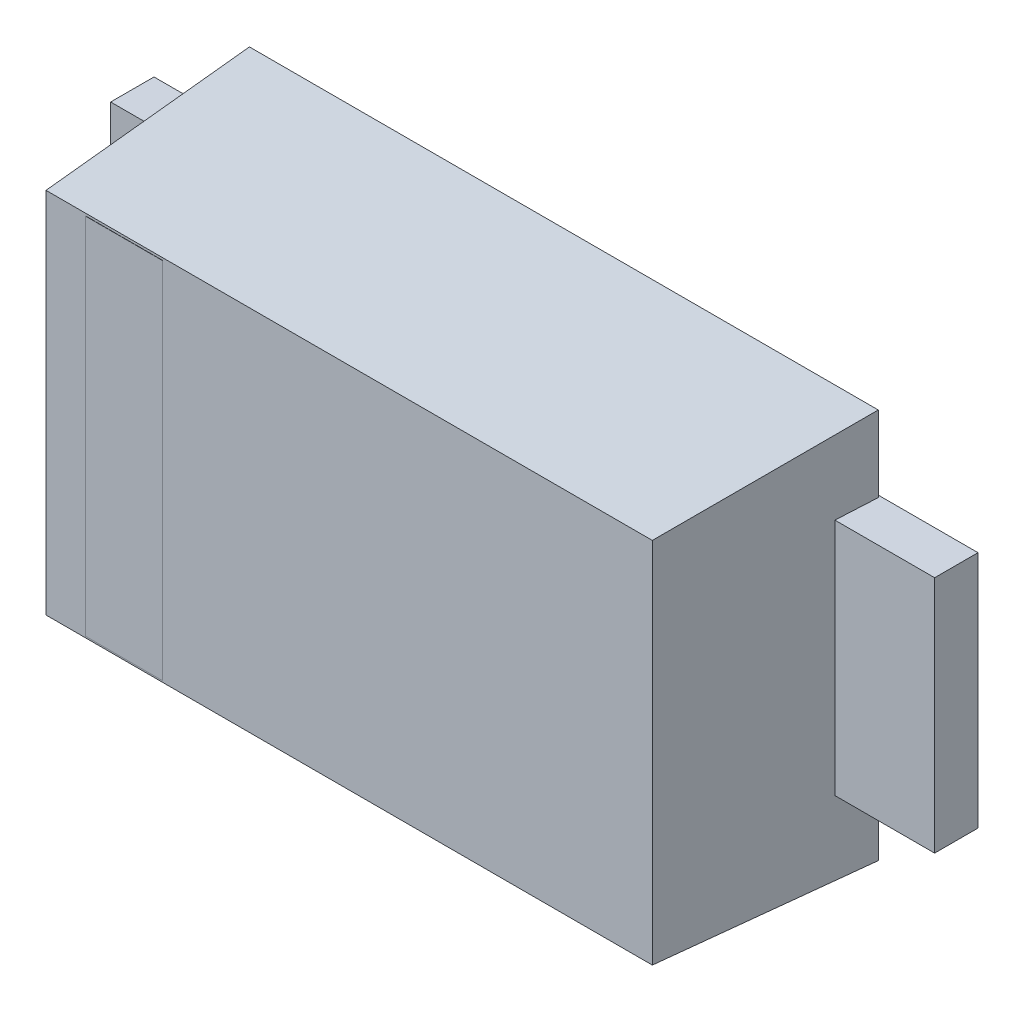
ISO-10303-21;
HEADER;
FILE_DESCRIPTION(('STEP AP214'),'2;1');
FILE_NAME('part.step','',(''),(''),'','','');
FILE_SCHEMA(('AUTOMOTIVE_DESIGN { 1 0 10303 214 1 1 1 1 }'));
ENDSEC;
DATA;
#1=APPLICATION_CONTEXT('core data for automotive mechanical design processes');
#2=APPLICATION_PROTOCOL_DEFINITION('international standard','automotive_design',2000,#1);
#3=PRODUCT_CONTEXT('',#1,'mechanical');
#4=PRODUCT('Part','Part','',(#3));
#5=PRODUCT_RELATED_PRODUCT_CATEGORY('part','',(#4));
#6=PRODUCT_DEFINITION_FORMATION('','',#4);
#7=PRODUCT_DEFINITION_CONTEXT('part definition',#1,'design');
#8=PRODUCT_DEFINITION('design','',#6,#7);
#9=PRODUCT_DEFINITION_SHAPE('','',#8);
#10=(LENGTH_UNIT() NAMED_UNIT(*) SI_UNIT(.MILLI.,.METRE.));
#11=(NAMED_UNIT(*) PLANE_ANGLE_UNIT() SI_UNIT($,.RADIAN.));
#12=(NAMED_UNIT(*) SI_UNIT($,.STERADIAN.) SOLID_ANGLE_UNIT());
#13=UNCERTAINTY_MEASURE_WITH_UNIT(LENGTH_MEASURE(1.E-05),#10,'distance_accuracy_value','');
#14=(GEOMETRIC_REPRESENTATION_CONTEXT(3) GLOBAL_UNCERTAINTY_ASSIGNED_CONTEXT((#13)) GLOBAL_UNIT_ASSIGNED_CONTEXT((#10,
#11,#12)) REPRESENTATION_CONTEXT('',''));
#15=CARTESIAN_POINT('',(0.,0.,0.));
#16=DIRECTION('',(0.,0.,1.));
#17=DIRECTION('',(1.,0.,0.));
#18=AXIS2_PLACEMENT_3D('',#15,#16,#17);
#19=CARTESIAN_POINT('',(-1.9,0.,0.));
#20=DIRECTION('',(-1.,0.,0.));
#21=DIRECTION('',(0.,0.,1.));
#22=AXIS2_PLACEMENT_3D('',#19,#20,#21);
#23=PLANE('',#22);
#24=DIRECTION('',(0.,1.,0.));
#25=VECTOR('',#24,1.);
#26=CARTESIAN_POINT('',(-1.9,0.,0.));
#27=LINE('',#26,#25);
#28=CARTESIAN_POINT('',(-1.9,0.55,0.));
#29=VERTEX_POINT('',#28);
#30=CARTESIAN_POINT('',(-1.9,-0.55,0.));
#31=VERTEX_POINT('',#30);
#32=EDGE_CURVE('E262',#29,#31,#27,.F.);
#33=ORIENTED_EDGE('',*,*,#32,.T.);
#34=DIRECTION('',(0.,0.,1.));
#35=VECTOR('',#34,1.);
#36=CARTESIAN_POINT('',(-1.9,-0.55,0.));
#37=LINE('',#36,#35);
#38=CARTESIAN_POINT('',(-1.9,-0.55,0.2));
#39=VERTEX_POINT('',#38);
#40=EDGE_CURVE('E237',#39,#31,#37,.F.);
#41=ORIENTED_EDGE('',*,*,#40,.F.);
#42=DIRECTION('',(0.,1.,0.));
#43=VECTOR('',#42,1.);
#44=CARTESIAN_POINT('',(-1.9,0.,0.2));
#45=LINE('',#44,#43);
#46=CARTESIAN_POINT('',(-1.9,0.55,0.2));
#47=VERTEX_POINT('',#46);
#48=EDGE_CURVE('E243',#47,#39,#45,.F.);
#49=ORIENTED_EDGE('',*,*,#48,.F.);
#50=DIRECTION('',(0.,0.,1.));
#51=VECTOR('',#50,1.);
#52=CARTESIAN_POINT('',(-1.9,0.55,0.));
#53=LINE('',#52,#51);
#54=EDGE_CURVE('E248',#29,#47,#53,.T.);
#55=ORIENTED_EDGE('',*,*,#54,.F.);
#56=EDGE_LOOP('',(#33,#41,#49,#55));
#57=FACE_BOUND('',#56,.T.);
#58=ADVANCED_FACE('F17',(#57),#23,.T.);
#59=CARTESIAN_POINT('',(-1.425,0.,0.));
#60=DIRECTION('',(0.,0.,1.));
#61=DIRECTION('',(1.,0.,0.));
#62=AXIS2_PLACEMENT_3D('',#59,#60,#61);
#63=PLANE('',#62);
#64=DIRECTION('',(-1.,0.,0.));
#65=VECTOR('',#64,1.);
#66=CARTESIAN_POINT('',(-1.425,0.55,0.));
#67=LINE('',#66,#65);
#68=CARTESIAN_POINT('',(-0.95,0.55,0.));
#69=VERTEX_POINT('',#68);
#70=EDGE_CURVE('E250',#69,#29,#67,.T.);
#71=ORIENTED_EDGE('',*,*,#70,.F.);
#72=DIRECTION('',(0.,1.,0.));
#73=VECTOR('',#72,1.);
#74=CARTESIAN_POINT('',(-0.95,0.,0.));
#75=LINE('',#74,#73);
#76=CARTESIAN_POINT('',(-0.95,-0.55,0.));
#77=VERTEX_POINT('',#76);
#78=EDGE_CURVE('E260',#77,#69,#75,.T.);
#79=ORIENTED_EDGE('',*,*,#78,.F.);
#80=DIRECTION('',(1.,0.,0.));
#81=VECTOR('',#80,1.);
#82=CARTESIAN_POINT('',(-1.425,-0.55,0.));
#83=LINE('',#82,#81);
#84=EDGE_CURVE('E234',#31,#77,#83,.T.);
#85=ORIENTED_EDGE('',*,*,#84,.F.);
#86=ORIENTED_EDGE('',*,*,#32,.F.);
#87=EDGE_LOOP('',(#71,#79,#85,#86));
#88=FACE_BOUND('',#87,.T.);
#89=ADVANCED_FACE('F557',(#88),#63,.F.);
#90=CARTESIAN_POINT('',(-0.95,0.,0.));
#91=DIRECTION('',(1.,0.,0.));
#92=DIRECTION('',(0.,0.,-1.));
#93=AXIS2_PLACEMENT_3D('',#90,#91,#92);
#94=PLANE('',#93);
#95=ORIENTED_EDGE('',*,*,#78,.T.);
#96=DIRECTION('',(0.,0.,1.));
#97=VECTOR('',#96,1.);
#98=CARTESIAN_POINT('',(-0.95,0.55,0.));
#99=LINE('',#98,#97);
#100=CARTESIAN_POINT('',(-0.95,0.55,0.01));
#101=VERTEX_POINT('',#100);
#102=EDGE_CURVE('E253',#101,#69,#99,.F.);
#103=ORIENTED_EDGE('',*,*,#102,.F.);
#104=DIRECTION('',(0.,-1.,0.));
#105=VECTOR('',#104,1.);
#106=CARTESIAN_POINT('',(-0.95,0.,0.01));
#107=LINE('',#106,#105);
#108=CARTESIAN_POINT('',(-0.95,-0.55,0.01));
#109=VERTEX_POINT('',#108);
#110=EDGE_CURVE('E229',#101,#109,#107,.T.);
#111=ORIENTED_EDGE('',*,*,#110,.T.);
#112=DIRECTION('',(0.,0.,1.));
#113=VECTOR('',#112,1.);
#114=CARTESIAN_POINT('',(-0.95,-0.55,0.));
#115=LINE('',#114,#113);
#116=EDGE_CURVE('E231',#77,#109,#115,.T.);
#117=ORIENTED_EDGE('',*,*,#116,.F.);
#118=EDGE_LOOP('',(#95,#103,#111,#117));
#119=FACE_BOUND('',#118,.T.);
#120=ADVANCED_FACE('F367',(#119),#94,.T.);
#121=CARTESIAN_POINT('',(1.9,0.,0.));
#122=DIRECTION('',(1.,0.,0.));
#123=DIRECTION('',(0.,0.,-1.));
#124=AXIS2_PLACEMENT_3D('',#121,#122,#123);
#125=PLANE('',#124);
#126=DIRECTION('',(0.,1.,0.));
#127=VECTOR('',#126,1.);
#128=CARTESIAN_POINT('',(1.9,0.,0.));
#129=LINE('',#128,#127);
#130=CARTESIAN_POINT('',(1.9,-0.55,0.));
#131=VERTEX_POINT('',#130);
#132=CARTESIAN_POINT('',(1.9,0.55,0.));
#133=VERTEX_POINT('',#132);
#134=EDGE_CURVE('E258',#131,#133,#129,.T.);
#135=ORIENTED_EDGE('',*,*,#134,.T.);
#136=DIRECTION('',(0.,0.,1.));
#137=VECTOR('',#136,1.);
#138=CARTESIAN_POINT('',(1.9,0.55,0.));
#139=LINE('',#138,#137);
#140=CARTESIAN_POINT('',(1.9,0.55,0.2));
#141=VERTEX_POINT('',#140);
#142=EDGE_CURVE('E193',#141,#133,#139,.F.);
#143=ORIENTED_EDGE('',*,*,#142,.F.);
#144=DIRECTION('',(0.,1.,0.));
#145=VECTOR('',#144,1.);
#146=CARTESIAN_POINT('',(1.9,0.,0.2));
#147=LINE('',#146,#145);
#148=CARTESIAN_POINT('',(1.9,-0.55,0.2));
#149=VERTEX_POINT('',#148);
#150=EDGE_CURVE('E202',#149,#141,#147,.T.);
#151=ORIENTED_EDGE('',*,*,#150,.F.);
#152=DIRECTION('',(0.,0.,1.));
#153=VECTOR('',#152,1.);
#154=CARTESIAN_POINT('',(1.9,-0.55,0.));
#155=LINE('',#154,#153);
#156=EDGE_CURVE('E207',#131,#149,#155,.T.);
#157=ORIENTED_EDGE('',*,*,#156,.F.);
#158=EDGE_LOOP('',(#135,#143,#151,#157));
#159=FACE_BOUND('',#158,.T.);
#160=ADVANCED_FACE('F354',(#159),#125,.T.);
#161=CARTESIAN_POINT('',(1.425,0.,0.));
#162=DIRECTION('',(0.,0.,1.));
#163=DIRECTION('',(1.,0.,0.));
#164=AXIS2_PLACEMENT_3D('',#161,#162,#163);
#165=PLANE('',#164);
#166=DIRECTION('',(1.,0.,0.));
#167=VECTOR('',#166,1.);
#168=CARTESIAN_POINT('',(1.425,-0.55,0.));
#169=LINE('',#168,#167);
#170=CARTESIAN_POINT('',(0.95,-0.55,0.));
#171=VERTEX_POINT('',#170);
#172=EDGE_CURVE('E209',#171,#131,#169,.T.);
#173=ORIENTED_EDGE('',*,*,#172,.F.);
#174=DIRECTION('',(0.,1.,0.));
#175=VECTOR('',#174,1.);
#176=CARTESIAN_POINT('',(0.95,0.,0.));
#177=LINE('',#176,#175);
#178=CARTESIAN_POINT('',(0.95,0.55,0.));
#179=VERTEX_POINT('',#178);
#180=EDGE_CURVE('E256',#179,#171,#177,.F.);
#181=ORIENTED_EDGE('',*,*,#180,.F.);
#182=DIRECTION('',(-1.,0.,0.));
#183=VECTOR('',#182,1.);
#184=CARTESIAN_POINT('',(1.425,0.55,0.));
#185=LINE('',#184,#183);
#186=EDGE_CURVE('E190',#133,#179,#185,.T.);
#187=ORIENTED_EDGE('',*,*,#186,.F.);
#188=ORIENTED_EDGE('',*,*,#134,.F.);
#189=EDGE_LOOP('',(#173,#181,#187,#188));
#190=FACE_BOUND('',#189,.T.);
#191=ADVANCED_FACE('F357',(#190),#165,.F.);
#192=CARTESIAN_POINT('',(0.95,0.,0.));
#193=DIRECTION('',(-1.,0.,0.));
#194=DIRECTION('',(0.,0.,1.));
#195=AXIS2_PLACEMENT_3D('',#192,#193,#194);
#196=PLANE('',#195);
#197=ORIENTED_EDGE('',*,*,#180,.T.);
#198=DIRECTION('',(0.,0.,1.));
#199=VECTOR('',#198,1.);
#200=CARTESIAN_POINT('',(0.95,-0.55,0.));
#201=LINE('',#200,#199);
#202=CARTESIAN_POINT('',(0.95,-0.55,0.01));
#203=VERTEX_POINT('',#202);
#204=EDGE_CURVE('E212',#203,#171,#201,.F.);
#205=ORIENTED_EDGE('',*,*,#204,.F.);
#206=DIRECTION('',(0.,-1.,0.));
#207=VECTOR('',#206,1.);
#208=CARTESIAN_POINT('',(0.95,0.,0.01));
#209=LINE('',#208,#207);
#210=CARTESIAN_POINT('',(0.95,0.55,0.01));
#211=VERTEX_POINT('',#210);
#212=EDGE_CURVE('E223',#203,#211,#209,.F.);
#213=ORIENTED_EDGE('',*,*,#212,.T.);
#214=DIRECTION('',(0.,0.,1.));
#215=VECTOR('',#214,1.);
#216=CARTESIAN_POINT('',(0.95,0.55,0.));
#217=LINE('',#216,#215);
#218=EDGE_CURVE('E187',#179,#211,#217,.T.);
#219=ORIENTED_EDGE('',*,*,#218,.F.);
#220=EDGE_LOOP('',(#197,#205,#213,#219));
#221=FACE_BOUND('',#220,.T.);
#222=ADVANCED_FACE('F342',(#221),#196,.T.);
#223=CARTESIAN_POINT('',(-1.037995629013,-0.001632086932659,1.001));
#224=DIRECTION('',(0.,0.,1.));
#225=DIRECTION('',(1.,0.,0.));
#226=AXIS2_PLACEMENT_3D('',#223,#224,#225);
#227=PLANE('',#226);
#228=DIRECTION('',(1.,0.,0.));
#229=VECTOR('',#228,1.);
#230=CARTESIAN_POINT('',(-1.037995629013,-0.840515270829,1.001));
#231=LINE('',#230,#229);
#232=CARTESIAN_POINT('',(-0.860100090504,-0.840515270829,1.001));
#233=VERTEX_POINT('',#232);
#234=CARTESIAN_POINT('',(-1.215891167521,-0.840515270829,1.001));
#235=VERTEX_POINT('',#234);
#236=EDGE_CURVE('E161',#233,#235,#231,.F.);
#237=ORIENTED_EDGE('',*,*,#236,.F.);
#238=DIRECTION('',(0.,1.,0.));
#239=VECTOR('',#238,1.);
#240=CARTESIAN_POINT('',(-0.860100090504,-0.001632086932659,1.001));
#241=LINE('',#240,#239);
#242=CARTESIAN_POINT('',(-0.860100090504,0.837251096964,1.001));
#243=VERTEX_POINT('',#242);
#244=EDGE_CURVE('E162',#243,#233,#241,.F.);
#245=ORIENTED_EDGE('',*,*,#244,.F.);
#246=DIRECTION('',(1.,0.,0.));
#247=VECTOR('',#246,1.);
#248=CARTESIAN_POINT('',(-1.037995629013,0.837251096964,1.001));
#249=LINE('',#248,#247);
#250=CARTESIAN_POINT('',(-1.215891167521,0.837251096964,1.001));
#251=VERTEX_POINT('',#250);
#252=EDGE_CURVE('E158',#251,#243,#249,.T.);
#253=ORIENTED_EDGE('',*,*,#252,.F.);
#254=DIRECTION('',(0.,1.,0.));
#255=VECTOR('',#254,1.);
#256=CARTESIAN_POINT('',(-1.215891167521,-0.001632086932659,1.001));
#257=LINE('',#256,#255);
#258=EDGE_CURVE('E269',#235,#251,#257,.T.);
#259=ORIENTED_EDGE('',*,*,#258,.F.);
#260=EDGE_LOOP('',(#237,#245,#253,#259));
#261=FACE_BOUND('',#260,.T.);
#262=ADVANCED_FACE('F365',(#261),#227,.T.);
#263=CARTESIAN_POINT('',(-1.425,0.55,0.));
#264=DIRECTION('',(0.,1.,0.));
#265=DIRECTION('',(-1.,0.,0.));
#266=AXIS2_PLACEMENT_3D('',#263,#264,#265);
#267=PLANE('',#266);
#268=DIRECTION('',(1.,0.,0.));
#269=VECTOR('',#268,1.);
#270=CARTESIAN_POINT('',(-1.425,0.55,0.2));
#271=LINE('',#270,#269);
#272=CARTESIAN_POINT('',(-1.44004252193606,0.55,0.200000000000003));
#273=VERTEX_POINT('',#272);
#274=EDGE_CURVE('E245',#273,#47,#271,.F.);
#275=ORIENTED_EDGE('',*,*,#274,.F.);
#276=DIRECTION('',(0.0523359562429177,0.,0.998629534754575));
#277=VECTOR('',#276,1.);
#278=CARTESIAN_POINT('',(-1.45,0.55,0.01));
#279=LINE('',#278,#277);
#280=CARTESIAN_POINT('',(-1.45,0.55,0.00999999999999999));
#281=VERTEX_POINT('',#280);
#282=EDGE_CURVE('E314',#281,#273,#279,.T.);
#283=ORIENTED_EDGE('',*,*,#282,.F.);
#284=DIRECTION('',(1.,0.,0.));
#285=VECTOR('',#284,1.);
#286=CARTESIAN_POINT('',(0.,0.55,0.01));
#287=LINE('',#286,#285);
#288=EDGE_CURVE('E218',#281,#101,#287,.T.);
#289=ORIENTED_EDGE('',*,*,#288,.T.);
#290=ORIENTED_EDGE('',*,*,#102,.T.);
#291=ORIENTED_EDGE('',*,*,#70,.T.);
#292=ORIENTED_EDGE('',*,*,#54,.T.);
#293=EDGE_LOOP('',(#275,#283,#289,#290,#291,#292));
#294=FACE_BOUND('',#293,.T.);
#295=ADVANCED_FACE('F407',(#294),#267,.T.);
#296=CARTESIAN_POINT('',(-1.425,0.,0.2));
#297=DIRECTION('',(0.,0.,1.));
#298=DIRECTION('',(1.,0.,0.));
#299=AXIS2_PLACEMENT_3D('',#296,#297,#298);
#300=PLANE('',#299);
#301=ORIENTED_EDGE('',*,*,#48,.T.);
#302=DIRECTION('',(1.,0.,0.));
#303=VECTOR('',#302,1.);
#304=CARTESIAN_POINT('',(-1.425,-0.55,0.2));
#305=LINE('',#304,#303);
#306=CARTESIAN_POINT('',(-1.44004252193606,-0.55,0.200000000000003));
#307=VERTEX_POINT('',#306);
#308=EDGE_CURVE('E240',#307,#39,#305,.F.);
#309=ORIENTED_EDGE('',*,*,#308,.F.);
#310=DIRECTION('',(0.,1.,0.));
#311=VECTOR('',#310,1.);
#312=CARTESIAN_POINT('',(-1.44004252193623,-0.9,0.200000000000012));
#313=LINE('',#312,#311);
#314=EDGE_CURVE('E312',#273,#307,#313,.F.);
#315=ORIENTED_EDGE('',*,*,#314,.F.);
#316=ORIENTED_EDGE('',*,*,#274,.T.);
#317=EDGE_LOOP('',(#301,#309,#315,#316));
#318=FACE_BOUND('',#317,.T.);
#319=ADVANCED_FACE('F403',(#318),#300,.T.);
#320=CARTESIAN_POINT('',(-1.425,-0.55,0.));
#321=DIRECTION('',(0.,-1.,0.));
#322=DIRECTION('',(1.,0.,0.));
#323=AXIS2_PLACEMENT_3D('',#320,#321,#322);
#324=PLANE('',#323);
#325=ORIENTED_EDGE('',*,*,#84,.T.);
#326=ORIENTED_EDGE('',*,*,#116,.T.);
#327=DIRECTION('',(1.,0.,0.));
#328=VECTOR('',#327,1.);
#329=CARTESIAN_POINT('',(0.,-0.55,0.01));
#330=LINE('',#329,#328);
#331=CARTESIAN_POINT('',(-1.45,-0.55,0.01));
#332=VERTEX_POINT('',#331);
#333=EDGE_CURVE('E227',#109,#332,#330,.F.);
#334=ORIENTED_EDGE('',*,*,#333,.T.);
#335=DIRECTION('',(0.0523359562429177,0.,0.998629534754575));
#336=VECTOR('',#335,1.);
#337=CARTESIAN_POINT('',(-1.45,-0.55,0.01));
#338=LINE('',#337,#336);
#339=EDGE_CURVE('E309',#307,#332,#338,.F.);
#340=ORIENTED_EDGE('',*,*,#339,.F.);
#341=ORIENTED_EDGE('',*,*,#308,.T.);
#342=ORIENTED_EDGE('',*,*,#40,.T.);
#343=EDGE_LOOP('',(#325,#326,#334,#340,#341,#342));
#344=FACE_BOUND('',#343,.T.);
#345=ADVANCED_FACE('F400',(#344),#324,.T.);
#346=CARTESIAN_POINT('',(0.,0.,0.01));
#347=DIRECTION('',(0.,0.,1.));
#348=DIRECTION('',(0.,-1.,0.));
#349=AXIS2_PLACEMENT_3D('',#346,#347,#348);
#350=PLANE('',#349);
#351=DIRECTION('',(0.,1.,0.));
#352=VECTOR('',#351,1.);
#353=CARTESIAN_POINT('',(-1.45,-0.9,0.01));
#354=LINE('',#353,#352);
#355=CARTESIAN_POINT('',(-1.45,0.9,0.00999999999999998));
#356=VERTEX_POINT('',#355);
#357=EDGE_CURVE('E301',#356,#281,#354,.F.);
#358=ORIENTED_EDGE('',*,*,#357,.F.);
#359=DIRECTION('',(1.,0.,0.));
#360=VECTOR('',#359,1.);
#361=CARTESIAN_POINT('',(-1.45,0.9,0.01));
#362=LINE('',#361,#360);
#363=CARTESIAN_POINT('',(1.45,0.9,0.01));
#364=VERTEX_POINT('',#363);
#365=EDGE_CURVE('E267',#364,#356,#362,.F.);
#366=ORIENTED_EDGE('',*,*,#365,.F.);
#367=DIRECTION('',(0.,-1.,0.));
#368=VECTOR('',#367,1.);
#369=CARTESIAN_POINT('',(1.45,0.,0.01));
#370=LINE('',#369,#368);
#371=CARTESIAN_POINT('',(1.45,0.55,0.01));
#372=VERTEX_POINT('',#371);
#373=EDGE_CURVE('E221',#372,#364,#370,.F.);
#374=ORIENTED_EDGE('',*,*,#373,.F.);
#375=DIRECTION('',(-1.,0.,0.));
#376=VECTOR('',#375,1.);
#377=CARTESIAN_POINT('',(1.425,0.55,0.01));
#378=LINE('',#377,#376);
#379=EDGE_CURVE('E199',#211,#372,#378,.F.);
#380=ORIENTED_EDGE('',*,*,#379,.F.);
#381=ORIENTED_EDGE('',*,*,#212,.F.);
#382=DIRECTION('',(1.,0.,0.));
#383=VECTOR('',#382,1.);
#384=CARTESIAN_POINT('',(1.425,-0.55,0.01));
#385=LINE('',#384,#383);
#386=CARTESIAN_POINT('',(1.45,-0.55,0.01));
#387=VERTEX_POINT('',#386);
#388=EDGE_CURVE('E215',#387,#203,#385,.F.);
#389=ORIENTED_EDGE('',*,*,#388,.F.);
#390=DIRECTION('',(0.,-1.,0.));
#391=VECTOR('',#390,1.);
#392=CARTESIAN_POINT('',(1.45,0.,0.01));
#393=LINE('',#392,#391);
#394=CARTESIAN_POINT('',(1.45,-0.9,0.00999999999999998));
#395=VERTEX_POINT('',#394);
#396=EDGE_CURVE('E225',#395,#387,#393,.F.);
#397=ORIENTED_EDGE('',*,*,#396,.F.);
#398=DIRECTION('',(1.,0.,0.));
#399=VECTOR('',#398,1.);
#400=CARTESIAN_POINT('',(1.45,-0.9,0.01));
#401=LINE('',#400,#399);
#402=CARTESIAN_POINT('',(-1.45,-0.9,0.01));
#403=VERTEX_POINT('',#402);
#404=EDGE_CURVE('E296',#403,#395,#401,.T.);
#405=ORIENTED_EDGE('',*,*,#404,.F.);
#406=DIRECTION('',(0.,1.,0.));
#407=VECTOR('',#406,1.);
#408=CARTESIAN_POINT('',(-1.45,-0.9,0.01));
#409=LINE('',#408,#407);
#410=EDGE_CURVE('E307',#332,#403,#409,.F.);
#411=ORIENTED_EDGE('',*,*,#410,.F.);
#412=ORIENTED_EDGE('',*,*,#333,.F.);
#413=ORIENTED_EDGE('',*,*,#110,.F.);
#414=ORIENTED_EDGE('',*,*,#288,.F.);
#415=EDGE_LOOP('',(#358,#366,#374,#380,#381,#389,#397,#405,#411,#412,#413,#414));
#416=FACE_BOUND('',#415,.T.);
#417=ADVANCED_FACE('F325',(#416),#350,.F.);
#418=CARTESIAN_POINT('',(1.425,-0.55,0.));
#419=DIRECTION('',(0.,-1.,0.));
#420=DIRECTION('',(1.,0.,0.));
#421=AXIS2_PLACEMENT_3D('',#418,#419,#420);
#422=PLANE('',#421);
#423=DIRECTION('',(1.,0.,0.));
#424=VECTOR('',#423,1.);
#425=CARTESIAN_POINT('',(1.425,-0.55,0.2));
#426=LINE('',#425,#424);
#427=CARTESIAN_POINT('',(1.44004252193606,-0.55,0.200000000000003));
#428=VERTEX_POINT('',#427);
#429=EDGE_CURVE('E204',#428,#149,#426,.T.);
#430=ORIENTED_EDGE('',*,*,#429,.F.);
#431=DIRECTION('',(0.0523359562429177,0.,-0.998629534754575));
#432=VECTOR('',#431,1.);
#433=CARTESIAN_POINT('',(1.45,-0.55,0.01));
#434=LINE('',#433,#432);
#435=EDGE_CURVE('E293',#387,#428,#434,.F.);
#436=ORIENTED_EDGE('',*,*,#435,.F.);
#437=ORIENTED_EDGE('',*,*,#388,.T.);
#438=ORIENTED_EDGE('',*,*,#204,.T.);
#439=ORIENTED_EDGE('',*,*,#172,.T.);
#440=ORIENTED_EDGE('',*,*,#156,.T.);
#441=EDGE_LOOP('',(#430,#436,#437,#438,#439,#440));
#442=FACE_BOUND('',#441,.T.);
#443=ADVANCED_FACE('F347',(#442),#422,.T.);
#444=CARTESIAN_POINT('',(1.425,0.,0.2));
#445=DIRECTION('',(0.,0.,1.));
#446=DIRECTION('',(1.,0.,0.));
#447=AXIS2_PLACEMENT_3D('',#444,#445,#446);
#448=PLANE('',#447);
#449=ORIENTED_EDGE('',*,*,#150,.T.);
#450=DIRECTION('',(-1.,0.,0.));
#451=VECTOR('',#450,1.);
#452=CARTESIAN_POINT('',(1.425,0.55,0.2));
#453=LINE('',#452,#451);
#454=CARTESIAN_POINT('',(1.44004252193606,0.55,0.200000000000003));
#455=VERTEX_POINT('',#454);
#456=EDGE_CURVE('E196',#455,#141,#453,.F.);
#457=ORIENTED_EDGE('',*,*,#456,.F.);
#458=DIRECTION('',(0.,1.,0.));
#459=VECTOR('',#458,1.);
#460=CARTESIAN_POINT('',(1.44004252193623,0.9,0.200000000000012));
#461=LINE('',#460,#459);
#462=EDGE_CURVE('E290',#428,#455,#461,.T.);
#463=ORIENTED_EDGE('',*,*,#462,.F.);
#464=ORIENTED_EDGE('',*,*,#429,.T.);
#465=EDGE_LOOP('',(#449,#457,#463,#464));
#466=FACE_BOUND('',#465,.T.);
#467=ADVANCED_FACE('F350',(#466),#448,.T.);
#468=CARTESIAN_POINT('',(1.425,0.55,0.));
#469=DIRECTION('',(0.,1.,0.));
#470=DIRECTION('',(-1.,0.,0.));
#471=AXIS2_PLACEMENT_3D('',#468,#469,#470);
#472=PLANE('',#471);
#473=ORIENTED_EDGE('',*,*,#186,.T.);
#474=ORIENTED_EDGE('',*,*,#218,.T.);
#475=ORIENTED_EDGE('',*,*,#379,.T.);
#476=DIRECTION('',(0.0523359562429177,0.,-0.998629534754575));
#477=VECTOR('',#476,1.);
#478=CARTESIAN_POINT('',(1.45,0.55,0.01));
#479=LINE('',#478,#477);
#480=EDGE_CURVE('E287',#455,#372,#479,.T.);
#481=ORIENTED_EDGE('',*,*,#480,.F.);
#482=ORIENTED_EDGE('',*,*,#456,.T.);
#483=ORIENTED_EDGE('',*,*,#142,.T.);
#484=EDGE_LOOP('',(#473,#474,#475,#481,#482,#483));
#485=FACE_BOUND('',#484,.T.);
#486=ADVANCED_FACE('F338',(#485),#472,.T.);
#487=CARTESIAN_POINT('',(-1.037995629013,0.837251096964,1.));
#488=DIRECTION('',(0.,1.,0.));
#489=DIRECTION('',(0.,0.,1.));
#490=AXIS2_PLACEMENT_3D('',#487,#488,#489);
#491=PLANE('',#490);
#492=DIRECTION('',(1.,0.,0.));
#493=VECTOR('',#492,1.);
#494=CARTESIAN_POINT('',(0.,0.837251096964,1.));
#495=LINE('',#494,#493);
#496=CARTESIAN_POINT('',(-1.215891167521,0.837251096964,1.));
#497=VERTEX_POINT('',#496);
#498=CARTESIAN_POINT('',(-0.860100090504,0.837251096964,1.));
#499=VERTEX_POINT('',#498);
#500=EDGE_CURVE('E156',#497,#499,#495,.T.);
#501=ORIENTED_EDGE('',*,*,#500,.F.);
#502=DIRECTION('',(0.,0.,1.));
#503=VECTOR('',#502,1.);
#504=CARTESIAN_POINT('',(-1.215891167521,0.837251096964,1.));
#505=LINE('',#504,#503);
#506=EDGE_CURVE('E268',#251,#497,#505,.F.);
#507=ORIENTED_EDGE('',*,*,#506,.F.);
#508=ORIENTED_EDGE('',*,*,#252,.T.);
#509=DIRECTION('',(0.,0.,-1.));
#510=VECTOR('',#509,1.);
#511=CARTESIAN_POINT('',(-0.860100090504,0.837251096964,1.));
#512=LINE('',#511,#510);
#513=EDGE_CURVE('E20',#499,#243,#512,.F.);
#514=ORIENTED_EDGE('',*,*,#513,.F.);
#515=EDGE_LOOP('',(#501,#507,#508,#514));
#516=FACE_BOUND('',#515,.T.);
#517=ADVANCED_FACE('F153',(#516),#491,.T.);
#518=CARTESIAN_POINT('',(-0.860100090504,-0.001632086932659,1.));
#519=DIRECTION('',(1.,0.,0.));
#520=DIRECTION('',(0.,0.,-1.));
#521=AXIS2_PLACEMENT_3D('',#518,#519,#520);
#522=PLANE('',#521);
#523=DIRECTION('',(0.,1.,0.));
#524=VECTOR('',#523,1.);
#525=CARTESIAN_POINT('',(-0.860100090504,0.,1.));
#526=LINE('',#525,#524);
#527=CARTESIAN_POINT('',(-0.860100090504,-0.840515270829,1.));
#528=VERTEX_POINT('',#527);
#529=EDGE_CURVE('E164',#499,#528,#526,.F.);
#530=ORIENTED_EDGE('',*,*,#529,.F.);
#531=ORIENTED_EDGE('',*,*,#513,.T.);
#532=ORIENTED_EDGE('',*,*,#244,.T.);
#533=DIRECTION('',(0.,0.,-1.));
#534=VECTOR('',#533,1.);
#535=CARTESIAN_POINT('',(-0.860100090504,-0.840515270829,1.));
#536=LINE('',#535,#534);
#537=EDGE_CURVE('E167',#528,#233,#536,.F.);
#538=ORIENTED_EDGE('',*,*,#537,.F.);
#539=EDGE_LOOP('',(#530,#531,#532,#538));
#540=FACE_BOUND('',#539,.T.);
#541=ADVANCED_FACE('F165',(#540),#522,.T.);
#542=CARTESIAN_POINT('',(-1.037995629013,-0.840515270829,1.));
#543=DIRECTION('',(0.,-1.,0.));
#544=DIRECTION('',(0.,0.,-1.));
#545=AXIS2_PLACEMENT_3D('',#542,#543,#544);
#546=PLANE('',#545);
#547=DIRECTION('',(1.,0.,0.));
#548=VECTOR('',#547,1.);
#549=CARTESIAN_POINT('',(0.,-0.840515270829,1.));
#550=LINE('',#549,#548);
#551=CARTESIAN_POINT('',(-1.215891167521,-0.840515270829,1.));
#552=VERTEX_POINT('',#551);
#553=EDGE_CURVE('E171',#528,#552,#550,.F.);
#554=ORIENTED_EDGE('',*,*,#553,.F.);
#555=ORIENTED_EDGE('',*,*,#537,.T.);
#556=ORIENTED_EDGE('',*,*,#236,.T.);
#557=DIRECTION('',(0.,0.,1.));
#558=VECTOR('',#557,1.);
#559=CARTESIAN_POINT('',(-1.215891167521,-0.840515270829,1.));
#560=LINE('',#559,#558);
#561=EDGE_CURVE('E264',#552,#235,#560,.T.);
#562=ORIENTED_EDGE('',*,*,#561,.F.);
#563=EDGE_LOOP('',(#554,#555,#556,#562));
#564=FACE_BOUND('',#563,.T.);
#565=ADVANCED_FACE('F385',(#564),#546,.T.);
#566=CARTESIAN_POINT('',(-1.215891167521,-0.001632086932659,1.));
#567=DIRECTION('',(-1.,0.,0.));
#568=DIRECTION('',(0.,0.,1.));
#569=AXIS2_PLACEMENT_3D('',#566,#567,#568);
#570=PLANE('',#569);
#571=DIRECTION('',(0.,1.,0.));
#572=VECTOR('',#571,1.);
#573=CARTESIAN_POINT('',(-1.215891167521,0.,1.));
#574=LINE('',#573,#572);
#575=EDGE_CURVE('E176',#552,#497,#574,.T.);
#576=ORIENTED_EDGE('',*,*,#575,.F.);
#577=ORIENTED_EDGE('',*,*,#561,.T.);
#578=ORIENTED_EDGE('',*,*,#258,.T.);
#579=ORIENTED_EDGE('',*,*,#506,.T.);
#580=EDGE_LOOP('',(#576,#577,#578,#579));
#581=FACE_BOUND('',#580,.T.);
#582=ADVANCED_FACE('F382',(#581),#570,.T.);
#583=CARTESIAN_POINT('',(-1.45,0.9,0.01));
#584=DIRECTION('',(0.,0.998629534754575,0.0523359562429177));
#585=DIRECTION('',(0.,-0.0523359562429177,0.998629534754575));
#586=AXIS2_PLACEMENT_3D('',#583,#584,#585);
#587=PLANE('',#586);
#588=ORIENTED_EDGE('',*,*,#365,.T.);
#589=DIRECTION('',(-0.0522644276886884,0.0522644276885027,-0.99726468863425));
#590=VECTOR('',#589,1.);
#591=CARTESIAN_POINT('',(-1.39811629850982,0.84811629851,0.99999999999999));
#592=LINE('',#591,#590);
#593=CARTESIAN_POINT('',(-1.39811629850995,0.848116298509908,0.999999999999993));
#594=VERTEX_POINT('',#593);
#595=EDGE_CURVE('E304',#594,#356,#592,.T.);
#596=ORIENTED_EDGE('',*,*,#595,.F.);
#597=DIRECTION('',(1.,0.,0.));
#598=VECTOR('',#597,1.);
#599=CARTESIAN_POINT('',(0.,0.84811629851,1.));
#600=LINE('',#599,#598);
#601=CARTESIAN_POINT('',(1.39811629850995,0.848116298509908,0.999999999999993));
#602=VERTEX_POINT('',#601);
#603=EDGE_CURVE('E276',#602,#594,#600,.F.);
#604=ORIENTED_EDGE('',*,*,#603,.F.);
#605=DIRECTION('',(-0.0522644276886884,-0.0522644276885028,0.99726468863425));
#606=VECTOR('',#605,1.);
#607=CARTESIAN_POINT('',(1.45,0.9,0.01));
#608=LINE('',#607,#606);
#609=EDGE_CURVE('E178',#364,#602,#608,.T.);
#610=ORIENTED_EDGE('',*,*,#609,.F.);
#611=EDGE_LOOP('',(#588,#596,#604,#610));
#612=FACE_BOUND('',#611,.T.);
#613=ADVANCED_FACE('F321',(#612),#587,.T.);
#614=CARTESIAN_POINT('',(-1.45,-0.9,0.01));
#615=DIRECTION('',(-0.998629534754575,0.,0.0523359562429177));
#616=DIRECTION('',(0.0523359562429177,0.,0.998629534754575));
#617=AXIS2_PLACEMENT_3D('',#614,#615,#616);
#618=PLANE('',#617);
#619=ORIENTED_EDGE('',*,*,#595,.T.);
#620=ORIENTED_EDGE('',*,*,#357,.T.);
#621=ORIENTED_EDGE('',*,*,#282,.T.);
#622=ORIENTED_EDGE('',*,*,#314,.T.);
#623=ORIENTED_EDGE('',*,*,#339,.T.);
#624=ORIENTED_EDGE('',*,*,#410,.T.);
#625=DIRECTION('',(-0.0522644276885025,-0.0522644276886885,-0.99726468863425));
#626=VECTOR('',#625,1.);
#627=CARTESIAN_POINT('',(-1.39811629851,-0.848116298509816,0.99999999999999));
#628=LINE('',#627,#626);
#629=CARTESIAN_POINT('',(-1.39811629850991,-0.848116298509954,0.999999999999993));
#630=VERTEX_POINT('',#629);
#631=EDGE_CURVE('E298',#630,#403,#628,.T.);
#632=ORIENTED_EDGE('',*,*,#631,.F.);
#633=DIRECTION('',(0.,1.,0.));
#634=VECTOR('',#633,1.);
#635=CARTESIAN_POINT('',(-1.39811629851,0.,1.));
#636=LINE('',#635,#634);
#637=EDGE_CURVE('E278',#594,#630,#636,.F.);
#638=ORIENTED_EDGE('',*,*,#637,.F.);
#639=EDGE_LOOP('',(#619,#620,#621,#622,#623,#624,#632,#638));
#640=FACE_BOUND('',#639,.T.);
#641=ADVANCED_FACE('F327',(#640),#618,.T.);
#642=CARTESIAN_POINT('',(1.45,-0.9,0.01));
#643=DIRECTION('',(0.,-0.998629534754575,0.0523359562429177));
#644=DIRECTION('',(0.,-0.0523359562429177,-0.998629534754575));
#645=AXIS2_PLACEMENT_3D('',#642,#643,#644);
#646=PLANE('',#645);
#647=ORIENTED_EDGE('',*,*,#404,.T.);
#648=DIRECTION('',(0.0522644276886884,-0.0522644276885027,-0.99726468863425));
#649=VECTOR('',#648,1.);
#650=CARTESIAN_POINT('',(1.39811629850982,-0.84811629851,0.99999999999999));
#651=LINE('',#650,#649);
#652=CARTESIAN_POINT('',(1.39811629850995,-0.848116298509908,0.999999999999993));
#653=VERTEX_POINT('',#652);
#654=EDGE_CURVE('E35',#653,#395,#651,.T.);
#655=ORIENTED_EDGE('',*,*,#654,.F.);
#656=DIRECTION('',(1.,0.,0.));
#657=VECTOR('',#656,1.);
#658=CARTESIAN_POINT('',(0.,-0.84811629851,1.));
#659=LINE('',#658,#657);
#660=EDGE_CURVE('E26',#630,#653,#659,.T.);
#661=ORIENTED_EDGE('',*,*,#660,.F.);
#662=ORIENTED_EDGE('',*,*,#631,.T.);
#663=EDGE_LOOP('',(#647,#655,#661,#662));
#664=FACE_BOUND('',#663,.T.);
#665=ADVANCED_FACE('F329',(#664),#646,.T.);
#666=CARTESIAN_POINT('',(1.45,0.9,0.01));
#667=DIRECTION('',(0.998629534754575,0.,0.0523359562429177));
#668=DIRECTION('',(0.0523359562429177,0.,-0.998629534754575));
#669=AXIS2_PLACEMENT_3D('',#666,#667,#668);
#670=PLANE('',#669);
#671=ORIENTED_EDGE('',*,*,#654,.T.);
#672=ORIENTED_EDGE('',*,*,#396,.T.);
#673=ORIENTED_EDGE('',*,*,#435,.T.);
#674=ORIENTED_EDGE('',*,*,#462,.T.);
#675=ORIENTED_EDGE('',*,*,#480,.T.);
#676=ORIENTED_EDGE('',*,*,#373,.T.);
#677=ORIENTED_EDGE('',*,*,#609,.T.);
#678=DIRECTION('',(0.,1.,0.));
#679=VECTOR('',#678,1.);
#680=CARTESIAN_POINT('',(1.39811629851,0.,1.));
#681=LINE('',#680,#679);
#682=EDGE_CURVE('E11',#653,#602,#681,.T.);
#683=ORIENTED_EDGE('',*,*,#682,.F.);
#684=EDGE_LOOP('',(#671,#672,#673,#674,#675,#676,#677,#683));
#685=FACE_BOUND('',#684,.T.);
#686=ADVANCED_FACE('F333',(#685),#670,.T.);
#687=CARTESIAN_POINT('',(0.,0.,1.));
#688=DIRECTION('',(0.,0.,1.));
#689=DIRECTION('',(1.,0.,0.));
#690=AXIS2_PLACEMENT_3D('',#687,#688,#689);
#691=PLANE('',#690);
#692=ORIENTED_EDGE('',*,*,#660,.T.);
#693=ORIENTED_EDGE('',*,*,#682,.T.);
#694=ORIENTED_EDGE('',*,*,#603,.T.);
#695=ORIENTED_EDGE('',*,*,#637,.T.);
#696=EDGE_LOOP('',(#692,#693,#694,#695));
#697=FACE_BOUND('',#696,.T.);
#698=ORIENTED_EDGE('',*,*,#553,.T.);
#699=ORIENTED_EDGE('',*,*,#575,.T.);
#700=ORIENTED_EDGE('',*,*,#500,.T.);
#701=ORIENTED_EDGE('',*,*,#529,.T.);
#702=EDGE_LOOP('',(#698,#699,#700,#701));
#703=FACE_BOUND('',#702,.T.);
#704=ADVANCED_FACE('F174',(#697,#703),#691,.T.);
#705=CLOSED_SHELL('',(#58,#89,#120,#160,#191,#222,#262,#295,#319,#345,#417,#443,#467,#486,#517,
#541,#565,#582,#613,#641,#665,#686,#704));
#706=MANIFOLD_SOLID_BREP('B1',#705);
#707=ADVANCED_BREP_SHAPE_REPRESENTATION('',(#18,#706),#14);
#708=SHAPE_DEFINITION_REPRESENTATION(#9,#707);
ENDSEC;
END-ISO-10303-21;
